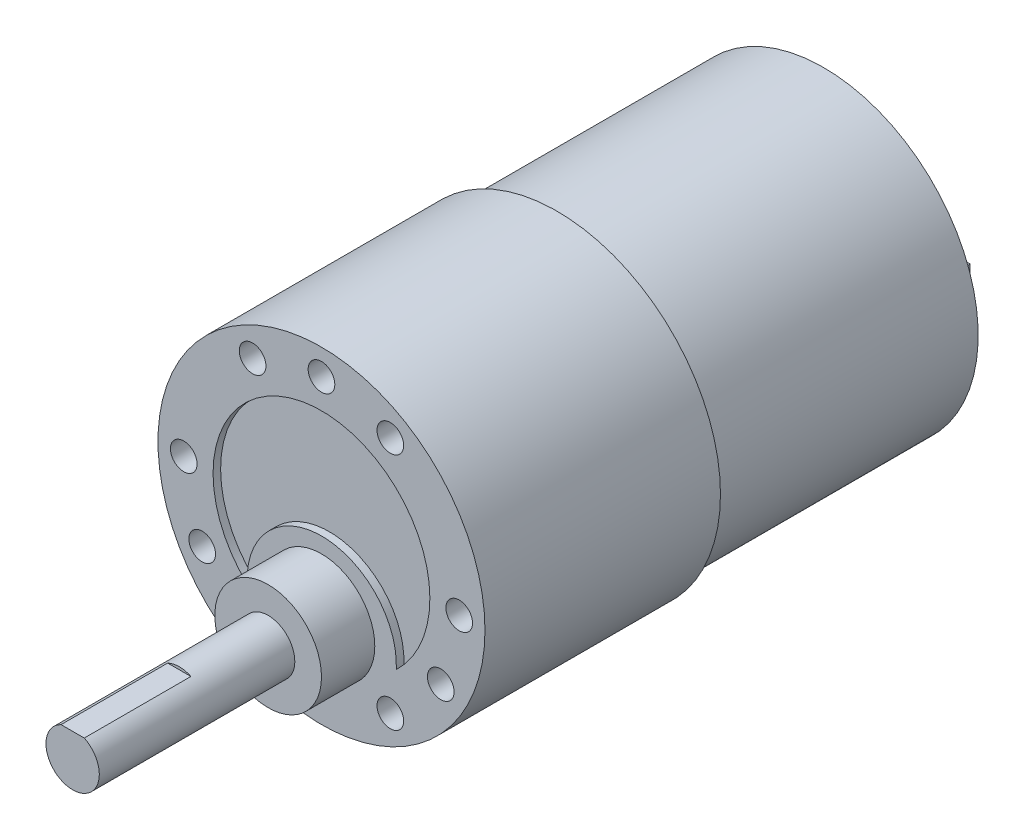
ISO-10303-21;
HEADER;
FILE_DESCRIPTION(('STEP AP214'),'2;1');
FILE_NAME('part.step','',(''),(''),'','','');
FILE_SCHEMA(('AUTOMOTIVE_DESIGN { 1 0 10303 214 1 1 1 1 }'));
ENDSEC;
DATA;
#1=APPLICATION_CONTEXT('core data for automotive mechanical design processes');
#2=APPLICATION_PROTOCOL_DEFINITION('international standard','automotive_design',2000,#1);
#3=PRODUCT_CONTEXT('',#1,'mechanical');
#4=PRODUCT('Part','Part','',(#3));
#5=PRODUCT_RELATED_PRODUCT_CATEGORY('part','',(#4));
#6=PRODUCT_DEFINITION_FORMATION('','',#4);
#7=PRODUCT_DEFINITION_CONTEXT('part definition',#1,'design');
#8=PRODUCT_DEFINITION('design','',#6,#7);
#9=PRODUCT_DEFINITION_SHAPE('','',#8);
#10=(LENGTH_UNIT() NAMED_UNIT(*) SI_UNIT(.MILLI.,.METRE.));
#11=(NAMED_UNIT(*) PLANE_ANGLE_UNIT() SI_UNIT($,.RADIAN.));
#12=(NAMED_UNIT(*) SI_UNIT($,.STERADIAN.) SOLID_ANGLE_UNIT());
#13=UNCERTAINTY_MEASURE_WITH_UNIT(LENGTH_MEASURE(1.E-05),#10,'distance_accuracy_value','');
#14=(GEOMETRIC_REPRESENTATION_CONTEXT(3) GLOBAL_UNCERTAINTY_ASSIGNED_CONTEXT((#13)) GLOBAL_UNIT_ASSIGNED_CONTEXT((#10,
#11,#12)) REPRESENTATION_CONTEXT('',''));
#15=CARTESIAN_POINT('',(0.,0.,0.));
#16=DIRECTION('',(0.,0.,1.));
#17=DIRECTION('',(1.,0.,0.));
#18=AXIS2_PLACEMENT_3D('',#15,#16,#17);
#19=CARTESIAN_POINT('',(0.,0.,-30.));
#20=DIRECTION('',(0.,0.,-1.));
#21=DIRECTION('',(-1.,0.,0.));
#22=AXIS2_PLACEMENT_3D('',#19,#20,#21);
#23=PLANE('',#22);
#24=CARTESIAN_POINT('',(11.25,0.,-30.));
#25=DIRECTION('',(0.,0.,-1.));
#26=DIRECTION('',(-1.,0.,0.));
#27=AXIS2_PLACEMENT_3D('',#24,#25,#26);
#28=CIRCLE('',#27,2.25);
#29=CARTESIAN_POINT('',(9.,0.,-30.));
#30=VERTEX_POINT('',#29);
#31=EDGE_CURVE('E217',#30,#30,#28,.T.);
#32=ORIENTED_EDGE('',*,*,#31,.F.);
#33=EDGE_LOOP('',(#32));
#34=FACE_BOUND('',#33,.T.);
#35=CARTESIAN_POINT('',(0.,0.,-30.));
#36=DIRECTION('',(0.,0.,-1.));
#37=DIRECTION('',(-1.,0.,0.));
#38=AXIS2_PLACEMENT_3D('',#35,#36,#37);
#39=CIRCLE('',#38,3.9);
#40=CARTESIAN_POINT('',(-3.9,0.,-30.));
#41=VERTEX_POINT('',#40);
#42=EDGE_CURVE('E12',#41,#41,#39,.T.);
#43=ORIENTED_EDGE('',*,*,#42,.F.);
#44=EDGE_LOOP('',(#43));
#45=FACE_BOUND('',#44,.T.);
#46=CARTESIAN_POINT('',(0.,0.,-30.));
#47=DIRECTION('',(0.,0.,-1.));
#48=DIRECTION('',(-1.,0.,0.));
#49=AXIS2_PLACEMENT_3D('',#46,#47,#48);
#50=CIRCLE('',#49,17.4);
#51=CARTESIAN_POINT('',(-17.4,0.,-30.));
#52=VERTEX_POINT('',#51);
#53=EDGE_CURVE('E225',#52,#52,#50,.T.);
#54=ORIENTED_EDGE('',*,*,#53,.T.);
#55=EDGE_LOOP('',(#54));
#56=FACE_BOUND('',#55,.T.);
#57=CARTESIAN_POINT('',(-11.25,0.,-30.));
#58=DIRECTION('',(0.,0.,-1.));
#59=DIRECTION('',(1.,0.,0.));
#60=AXIS2_PLACEMENT_3D('',#57,#58,#59);
#61=CIRCLE('',#60,2.25);
#62=CARTESIAN_POINT('',(-9.,0.,-30.));
#63=VERTEX_POINT('',#62);
#64=EDGE_CURVE('E199',#63,#63,#61,.T.);
#65=ORIENTED_EDGE('',*,*,#64,.F.);
#66=EDGE_LOOP('',(#65));
#67=FACE_BOUND('',#66,.T.);
#68=ADVANCED_FACE('F48',(#34,#45,#56,#67),#23,.T.);
#69=CARTESIAN_POINT('',(0.,0.,26.5));
#70=DIRECTION('',(0.,0.,-1.));
#71=DIRECTION('',(-1.,0.,0.));
#72=AXIS2_PLACEMENT_3D('',#69,#70,#71);
#73=CYLINDRICAL_SURFACE('',#72,18.4);
#74=CARTESIAN_POINT('',(0.,0.,26.5));
#75=DIRECTION('',(0.,0.,1.));
#76=DIRECTION('',(1.,0.,0.));
#77=AXIS2_PLACEMENT_3D('',#74,#75,#76);
#78=CIRCLE('',#77,18.4);
#79=CARTESIAN_POINT('',(18.4,0.,26.5));
#80=VERTEX_POINT('',#79);
#81=EDGE_CURVE('E249',#80,#80,#78,.T.);
#82=ORIENTED_EDGE('',*,*,#81,.F.);
#83=EDGE_LOOP('',(#82));
#84=FACE_BOUND('',#83,.T.);
#85=CARTESIAN_POINT('',(0.,0.,0.));
#86=DIRECTION('',(0.,0.,1.));
#87=DIRECTION('',(1.,0.,0.));
#88=AXIS2_PLACEMENT_3D('',#85,#86,#87);
#89=CIRCLE('',#88,18.4);
#90=CARTESIAN_POINT('',(18.4,0.,0.));
#91=VERTEX_POINT('',#90);
#92=EDGE_CURVE('E52',#91,#91,#89,.T.);
#93=ORIENTED_EDGE('',*,*,#92,.T.);
#94=EDGE_LOOP('',(#93));
#95=FACE_BOUND('',#94,.T.);
#96=ADVANCED_FACE('F50',(#84,#95),#73,.T.);
#97=CARTESIAN_POINT('',(0.,0.,26.5));
#98=DIRECTION('',(0.,0.,1.));
#99=DIRECTION('',(1.,0.,0.));
#100=AXIS2_PLACEMENT_3D('',#97,#98,#99);
#101=PLANE('',#100);
#102=CARTESIAN_POINT('',(-1.78589781851884E-12,-7.75000000000207,26.5));
#103=DIRECTION('',(0.,0.,1.));
#104=DIRECTION('',(1.,0.,0.));
#105=AXIS2_PLACEMENT_3D('',#102,#103,#104);
#106=CIRCLE('',#105,6.);
#107=CARTESIAN_POINT('',(5.99999999999821,-7.75000000000207,26.5));
#108=VERTEX_POINT('',#107);
#109=EDGE_CURVE('E246',#108,#108,#106,.T.);
#110=ORIENTED_EDGE('',*,*,#109,.F.);
#111=EDGE_LOOP('',(#110));
#112=FACE_BOUND('',#111,.T.);
#113=CARTESIAN_POINT('',(-15.5,0.,26.5));
#114=DIRECTION('',(0.,0.,1.));
#115=DIRECTION('',(1.,0.,0.));
#116=AXIS2_PLACEMENT_3D('',#113,#114,#115);
#117=CIRCLE('',#116,1.5);
#118=CARTESIAN_POINT('',(-14.,0.,26.5));
#119=VERTEX_POINT('',#118);
#120=EDGE_CURVE('E260',#119,#119,#117,.T.);
#121=ORIENTED_EDGE('',*,*,#120,.F.);
#122=EDGE_LOOP('',(#121));
#123=FACE_BOUND('',#122,.T.);
#124=CARTESIAN_POINT('',(-7.75000000000016,-13.4233937586587,26.5));
#125=DIRECTION('',(0.,0.,1.));
#126=DIRECTION('',(1.,0.,0.));
#127=AXIS2_PLACEMENT_3D('',#124,#125,#126);
#128=CIRCLE('',#127,1.5);
#129=CARTESIAN_POINT('',(-6.25000000000015,-13.4233937586587,26.5));
#130=VERTEX_POINT('',#129);
#131=EDGE_CURVE('E253',#130,#130,#128,.T.);
#132=ORIENTED_EDGE('',*,*,#131,.F.);
#133=EDGE_LOOP('',(#132));
#134=FACE_BOUND('',#133,.T.);
#135=CARTESIAN_POINT('',(7.74999999999987,-13.4233937586589,26.5));
#136=DIRECTION('',(0.,0.,1.));
#137=DIRECTION('',(1.,0.,0.));
#138=AXIS2_PLACEMENT_3D('',#135,#136,#137);
#139=CIRCLE('',#138,1.5);
#140=CARTESIAN_POINT('',(9.24999999999988,-13.4233937586589,26.5));
#141=VERTEX_POINT('',#140);
#142=EDGE_CURVE('E267',#141,#141,#139,.T.);
#143=ORIENTED_EDGE('',*,*,#142,.F.);
#144=EDGE_LOOP('',(#143));
#145=FACE_BOUND('',#144,.T.);
#146=CARTESIAN_POINT('',(15.5,-1.08235921504137E-13,26.5));
#147=DIRECTION('',(0.,0.,1.));
#148=DIRECTION('',(1.,0.,0.));
#149=AXIS2_PLACEMENT_3D('',#146,#147,#148);
#150=CIRCLE('',#149,1.5);
#151=CARTESIAN_POINT('',(17.,-1.08235921504137E-13,26.5));
#152=VERTEX_POINT('',#151);
#153=EDGE_CURVE('E284',#152,#152,#150,.T.);
#154=ORIENTED_EDGE('',*,*,#153,.F.);
#155=EDGE_LOOP('',(#154));
#156=FACE_BOUND('',#155,.T.);
#157=CARTESIAN_POINT('',(7.75000000000006,13.4233937586588,26.5));
#158=DIRECTION('',(0.,0.,1.));
#159=DIRECTION('',(1.,0.,0.));
#160=AXIS2_PLACEMENT_3D('',#157,#158,#159);
#161=CIRCLE('',#160,1.5);
#162=CARTESIAN_POINT('',(9.25000000000006,13.4233937586588,26.5));
#163=VERTEX_POINT('',#162);
#164=EDGE_CURVE('E278',#163,#163,#161,.T.);
#165=ORIENTED_EDGE('',*,*,#164,.F.);
#166=EDGE_LOOP('',(#165));
#167=FACE_BOUND('',#166,.T.);
#168=CARTESIAN_POINT('',(-7.74999999999997,13.4233937586588,26.5));
#169=DIRECTION('',(0.,0.,1.));
#170=DIRECTION('',(1.,0.,0.));
#171=AXIS2_PLACEMENT_3D('',#168,#169,#170);
#172=CIRCLE('',#171,1.5);
#173=CARTESIAN_POINT('',(-6.24999999999997,13.4233937586588,26.5));
#174=VERTEX_POINT('',#173);
#175=EDGE_CURVE('E272',#174,#174,#172,.T.);
#176=ORIENTED_EDGE('',*,*,#175,.F.);
#177=EDGE_LOOP('',(#176));
#178=FACE_BOUND('',#177,.T.);
#179=CARTESIAN_POINT('',(0.,15.5,26.5));
#180=DIRECTION('',(0.,0.,1.));
#181=DIRECTION('',(1.,0.,0.));
#182=AXIS2_PLACEMENT_3D('',#179,#180,#181);
#183=CIRCLE('',#182,1.5);
#184=CARTESIAN_POINT('',(1.5,15.5,26.5));
#185=VERTEX_POINT('',#184);
#186=EDGE_CURVE('E296',#185,#185,#183,.T.);
#187=ORIENTED_EDGE('',*,*,#186,.F.);
#188=EDGE_LOOP('',(#187));
#189=FACE_BOUND('',#188,.T.);
#190=CARTESIAN_POINT('',(13.4233937586576,-7.75000000000207,26.5));
#191=DIRECTION('',(0.,0.,1.));
#192=DIRECTION('',(1.,0.,0.));
#193=AXIS2_PLACEMENT_3D('',#190,#191,#192);
#194=CIRCLE('',#193,1.49999999999779);
#195=CARTESIAN_POINT('',(14.9233937586554,-7.75000000000207,26.5));
#196=VERTEX_POINT('',#195);
#197=EDGE_CURVE('E302',#196,#196,#194,.T.);
#198=ORIENTED_EDGE('',*,*,#197,.F.);
#199=EDGE_LOOP('',(#198));
#200=FACE_BOUND('',#199,.T.);
#201=CARTESIAN_POINT('',(-13.4233937586612,-7.74999999999587,26.5));
#202=DIRECTION('',(0.,0.,1.));
#203=DIRECTION('',(1.,0.,0.));
#204=AXIS2_PLACEMENT_3D('',#201,#202,#203);
#205=CIRCLE('',#204,1.49999999999558);
#206=CARTESIAN_POINT('',(-11.9233937586656,-7.74999999999587,26.5));
#207=VERTEX_POINT('',#206);
#208=EDGE_CURVE('E259',#207,#207,#205,.T.);
#209=ORIENTED_EDGE('',*,*,#208,.F.);
#210=EDGE_LOOP('',(#209));
#211=FACE_BOUND('',#210,.T.);
#212=CARTESIAN_POINT('',(0.0300122031200254,-8.39994638480889,26.5));
#213=DIRECTION('',(0.,0.,1.));
#214=DIRECTION('',(1.,0.,0.));
#215=AXIS2_PLACEMENT_3D('',#212,#213,#214);
#216=CIRCLE('',#215,8.4);
#217=CARTESIAN_POINT('',(-8.35571384552702,-8.88943452260424,26.5));
#218=VERTEX_POINT('',#217);
#219=CARTESIAN_POINT('',(8.41902189984086,-8.8295,26.5));
#220=VERTEX_POINT('',#219);
#221=EDGE_CURVE('E73',#218,#220,#216,.F.);
#222=ORIENTED_EDGE('',*,*,#221,.F.);
#223=CARTESIAN_POINT('',(0.,0.,26.5));
#224=DIRECTION('',(0.,0.,1.));
#225=DIRECTION('',(1.,0.,0.));
#226=AXIS2_PLACEMENT_3D('',#223,#224,#225);
#227=CIRCLE('',#226,12.2);
#228=EDGE_CURVE('E295',#220,#218,#227,.T.);
#229=ORIENTED_EDGE('',*,*,#228,.F.);
#230=EDGE_LOOP('',(#222,#229));
#231=FACE_BOUND('',#230,.T.);
#232=ORIENTED_EDGE('',*,*,#81,.T.);
#233=EDGE_LOOP('',(#232));
#234=FACE_BOUND('',#233,.T.);
#235=ADVANCED_FACE('F332',(#112,#123,#134,#145,#156,#167,#178,#189,#200,#211,#231,#234),#101,.T.);
#236=CARTESIAN_POINT('',(0.,0.,0.));
#237=DIRECTION('',(0.,0.,1.));
#238=DIRECTION('',(1.,0.,0.));
#239=AXIS2_PLACEMENT_3D('',#236,#237,#238);
#240=PLANE('',#239);
#241=CARTESIAN_POINT('',(0.,0.,0.));
#242=DIRECTION('',(0.,0.,-1.));
#243=DIRECTION('',(-1.,0.,0.));
#244=AXIS2_PLACEMENT_3D('',#241,#242,#243);
#245=CIRCLE('',#244,17.4);
#246=CARTESIAN_POINT('',(-17.4,0.,0.));
#247=VERTEX_POINT('',#246);
#248=EDGE_CURVE('E57',#247,#247,#245,.T.);
#249=ORIENTED_EDGE('',*,*,#248,.F.);
#250=EDGE_LOOP('',(#249));
#251=FACE_BOUND('',#250,.T.);
#252=ORIENTED_EDGE('',*,*,#92,.F.);
#253=EDGE_LOOP('',(#252));
#254=FACE_BOUND('',#253,.T.);
#255=ADVANCED_FACE('F329',(#251,#254),#240,.F.);
#256=CARTESIAN_POINT('',(0.0300122031200254,-8.39994638480889,25.65));
#257=DIRECTION('',(0.,0.,1.));
#258=DIRECTION('',(1.,0.,0.));
#259=AXIS2_PLACEMENT_3D('',#256,#257,#258);
#260=CYLINDRICAL_SURFACE('',#259,8.4);
#261=ORIENTED_EDGE('',*,*,#221,.T.);
#262=DIRECTION('',(0.,0.,1.));
#263=VECTOR('',#262,1.);
#264=CARTESIAN_POINT('',(8.41902189984086,-8.8295,25.65));
#265=LINE('',#264,#263);
#266=CARTESIAN_POINT('',(8.41902189984086,-8.8295,25.65));
#267=VERTEX_POINT('',#266);
#268=EDGE_CURVE('E320',#267,#220,#265,.T.);
#269=ORIENTED_EDGE('',*,*,#268,.F.);
#270=CARTESIAN_POINT('',(0.0300122031200254,-8.39994638480889,25.65));
#271=DIRECTION('',(0.,0.,1.));
#272=DIRECTION('',(1.,0.,0.));
#273=AXIS2_PLACEMENT_3D('',#270,#271,#272);
#274=CIRCLE('',#273,8.4);
#275=CARTESIAN_POINT('',(-8.35571384552702,-8.88943452260424,25.65));
#276=VERTEX_POINT('',#275);
#277=EDGE_CURVE('E313',#276,#267,#274,.F.);
#278=ORIENTED_EDGE('',*,*,#277,.F.);
#279=DIRECTION('',(0.,0.,1.));
#280=VECTOR('',#279,1.);
#281=CARTESIAN_POINT('',(-8.35571384552702,-8.88943452260424,25.65));
#282=LINE('',#281,#280);
#283=EDGE_CURVE('E316',#276,#218,#282,.T.);
#284=ORIENTED_EDGE('',*,*,#283,.T.);
#285=EDGE_LOOP('',(#261,#269,#278,#284));
#286=FACE_BOUND('',#285,.T.);
#287=ADVANCED_FACE('F331',(#286),#260,.T.);
#288=CARTESIAN_POINT('',(0.,0.,25.65));
#289=DIRECTION('',(0.,0.,1.));
#290=DIRECTION('',(1.,0.,0.));
#291=AXIS2_PLACEMENT_3D('',#288,#289,#290);
#292=CYLINDRICAL_SURFACE('',#291,12.2);
#293=ORIENTED_EDGE('',*,*,#228,.T.);
#294=ORIENTED_EDGE('',*,*,#283,.F.);
#295=CARTESIAN_POINT('',(0.,0.,25.65));
#296=DIRECTION('',(0.,0.,1.));
#297=DIRECTION('',(1.,0.,0.));
#298=AXIS2_PLACEMENT_3D('',#295,#296,#297);
#299=CIRCLE('',#298,12.2);
#300=EDGE_CURVE('E310',#267,#276,#299,.T.);
#301=ORIENTED_EDGE('',*,*,#300,.F.);
#302=ORIENTED_EDGE('',*,*,#268,.T.);
#303=EDGE_LOOP('',(#293,#294,#301,#302));
#304=FACE_BOUND('',#303,.T.);
#305=ADVANCED_FACE('F338',(#304),#292,.F.);
#306=CARTESIAN_POINT('',(0.,0.,25.65));
#307=DIRECTION('',(0.,0.,1.));
#308=DIRECTION('',(1.,0.,0.));
#309=AXIS2_PLACEMENT_3D('',#306,#307,#308);
#310=PLANE('',#309);
#311=ORIENTED_EDGE('',*,*,#300,.T.);
#312=ORIENTED_EDGE('',*,*,#277,.T.);
#313=EDGE_LOOP('',(#311,#312));
#314=FACE_BOUND('',#313,.T.);
#315=ADVANCED_FACE('F454',(#314),#310,.T.);
#316=CARTESIAN_POINT('',(-13.4233937586612,-7.74999999999587,1.5));
#317=DIRECTION('',(0.,0.,1.));
#318=DIRECTION('',(1.,0.,0.));
#319=AXIS2_PLACEMENT_3D('',#316,#317,#318);
#320=CYLINDRICAL_SURFACE('',#319,1.49999999999558);
#321=CARTESIAN_POINT('',(-13.4233937586612,-7.74999999999587,1.5));
#322=DIRECTION('',(0.,0.,1.));
#323=DIRECTION('',(1.,0.,0.));
#324=AXIS2_PLACEMENT_3D('',#321,#322,#323);
#325=CIRCLE('',#324,1.49999999999558);
#326=CARTESIAN_POINT('',(-11.9233937586656,-7.74999999999587,1.5));
#327=VERTEX_POINT('',#326);
#328=EDGE_CURVE('E305',#327,#327,#325,.T.);
#329=ORIENTED_EDGE('',*,*,#328,.F.);
#330=EDGE_LOOP('',(#329));
#331=FACE_BOUND('',#330,.T.);
#332=ORIENTED_EDGE('',*,*,#208,.T.);
#333=EDGE_LOOP('',(#332));
#334=FACE_BOUND('',#333,.T.);
#335=ADVANCED_FACE('F450',(#331,#334),#320,.F.);
#336=CARTESIAN_POINT('',(-13.4233937586612,-7.74999999999587,1.5));
#337=DIRECTION('',(0.,0.,1.));
#338=DIRECTION('',(1.,0.,0.));
#339=AXIS2_PLACEMENT_3D('',#336,#337,#338);
#340=PLANE('',#339);
#341=ORIENTED_EDGE('',*,*,#328,.T.);
#342=EDGE_LOOP('',(#341));
#343=FACE_BOUND('',#342,.T.);
#344=ADVANCED_FACE('F446',(#343),#340,.T.);
#345=CARTESIAN_POINT('',(13.4233937586576,-7.75000000000207,1.5));
#346=DIRECTION('',(0.,0.,1.));
#347=DIRECTION('',(1.,0.,0.));
#348=AXIS2_PLACEMENT_3D('',#345,#346,#347);
#349=CYLINDRICAL_SURFACE('',#348,1.49999999999779);
#350=CARTESIAN_POINT('',(13.4233937586576,-7.75000000000207,1.5));
#351=DIRECTION('',(0.,0.,1.));
#352=DIRECTION('',(1.,0.,0.));
#353=AXIS2_PLACEMENT_3D('',#350,#351,#352);
#354=CIRCLE('',#353,1.49999999999779);
#355=CARTESIAN_POINT('',(14.9233937586554,-7.75000000000207,1.5));
#356=VERTEX_POINT('',#355);
#357=EDGE_CURVE('E299',#356,#356,#354,.T.);
#358=ORIENTED_EDGE('',*,*,#357,.F.);
#359=EDGE_LOOP('',(#358));
#360=FACE_BOUND('',#359,.T.);
#361=ORIENTED_EDGE('',*,*,#197,.T.);
#362=EDGE_LOOP('',(#361));
#363=FACE_BOUND('',#362,.T.);
#364=ADVANCED_FACE('F442',(#360,#363),#349,.F.);
#365=CARTESIAN_POINT('',(13.4233937586576,-7.75000000000207,1.5));
#366=DIRECTION('',(0.,0.,1.));
#367=DIRECTION('',(1.,0.,0.));
#368=AXIS2_PLACEMENT_3D('',#365,#366,#367);
#369=PLANE('',#368);
#370=ORIENTED_EDGE('',*,*,#357,.T.);
#371=EDGE_LOOP('',(#370));
#372=FACE_BOUND('',#371,.T.);
#373=ADVANCED_FACE('F438',(#372),#369,.T.);
#374=CARTESIAN_POINT('',(0.,15.5,1.5));
#375=DIRECTION('',(0.,0.,1.));
#376=DIRECTION('',(1.,0.,0.));
#377=AXIS2_PLACEMENT_3D('',#374,#375,#376);
#378=CYLINDRICAL_SURFACE('',#377,1.5);
#379=CARTESIAN_POINT('',(0.,15.5,1.5));
#380=DIRECTION('',(0.,0.,1.));
#381=DIRECTION('',(1.,0.,0.));
#382=AXIS2_PLACEMENT_3D('',#379,#380,#381);
#383=CIRCLE('',#382,1.5);
#384=CARTESIAN_POINT('',(1.5,15.5,1.5));
#385=VERTEX_POINT('',#384);
#386=EDGE_CURVE('E292',#385,#385,#383,.T.);
#387=ORIENTED_EDGE('',*,*,#386,.F.);
#388=EDGE_LOOP('',(#387));
#389=FACE_BOUND('',#388,.T.);
#390=ORIENTED_EDGE('',*,*,#186,.T.);
#391=EDGE_LOOP('',(#390));
#392=FACE_BOUND('',#391,.T.);
#393=ADVANCED_FACE('F434',(#389,#392),#378,.F.);
#394=CARTESIAN_POINT('',(0.,15.5,1.5));
#395=DIRECTION('',(0.,0.,1.));
#396=DIRECTION('',(1.,0.,0.));
#397=AXIS2_PLACEMENT_3D('',#394,#395,#396);
#398=PLANE('',#397);
#399=ORIENTED_EDGE('',*,*,#386,.T.);
#400=EDGE_LOOP('',(#399));
#401=FACE_BOUND('',#400,.T.);
#402=ADVANCED_FACE('F408',(#401),#398,.T.);
#403=CARTESIAN_POINT('',(-7.74999999999997,13.4233937586588,21.5));
#404=DIRECTION('',(0.,0.,1.));
#405=DIRECTION('',(1.,0.,0.));
#406=AXIS2_PLACEMENT_3D('',#403,#404,#405);
#407=CYLINDRICAL_SURFACE('',#406,1.5);
#408=CARTESIAN_POINT('',(-7.74999999999997,13.4233937586588,21.5));
#409=DIRECTION('',(0.,0.,1.));
#410=DIRECTION('',(1.,0.,0.));
#411=AXIS2_PLACEMENT_3D('',#408,#409,#410);
#412=CIRCLE('',#411,1.5);
#413=CARTESIAN_POINT('',(-6.24999999999997,13.4233937586588,21.5));
#414=VERTEX_POINT('',#413);
#415=EDGE_CURVE('E263',#414,#414,#412,.T.);
#416=ORIENTED_EDGE('',*,*,#415,.F.);
#417=EDGE_LOOP('',(#416));
#418=FACE_BOUND('',#417,.T.);
#419=ORIENTED_EDGE('',*,*,#175,.T.);
#420=EDGE_LOOP('',(#419));
#421=FACE_BOUND('',#420,.T.);
#422=ADVANCED_FACE('F404',(#418,#421),#407,.F.);
#423=CARTESIAN_POINT('',(-7.74999999999997,13.4233937586588,21.5));
#424=DIRECTION('',(0.,0.,1.));
#425=DIRECTION('',(1.,0.,0.));
#426=AXIS2_PLACEMENT_3D('',#423,#424,#425);
#427=PLANE('',#426);
#428=ORIENTED_EDGE('',*,*,#415,.T.);
#429=EDGE_LOOP('',(#428));
#430=FACE_BOUND('',#429,.T.);
#431=ADVANCED_FACE('F400',(#430),#427,.T.);
#432=CARTESIAN_POINT('',(7.75000000000006,13.4233937586588,21.5));
#433=DIRECTION('',(0.,0.,1.));
#434=DIRECTION('',(1.,0.,0.));
#435=AXIS2_PLACEMENT_3D('',#432,#433,#434);
#436=CYLINDRICAL_SURFACE('',#435,1.5);
#437=CARTESIAN_POINT('',(7.75000000000006,13.4233937586588,21.5));
#438=DIRECTION('',(0.,0.,1.));
#439=DIRECTION('',(1.,0.,0.));
#440=AXIS2_PLACEMENT_3D('',#437,#438,#439);
#441=CIRCLE('',#440,1.5);
#442=CARTESIAN_POINT('',(9.25000000000006,13.4233937586588,21.5));
#443=VERTEX_POINT('',#442);
#444=EDGE_CURVE('E275',#443,#443,#441,.T.);
#445=ORIENTED_EDGE('',*,*,#444,.F.);
#446=EDGE_LOOP('',(#445));
#447=FACE_BOUND('',#446,.T.);
#448=ORIENTED_EDGE('',*,*,#164,.T.);
#449=EDGE_LOOP('',(#448));
#450=FACE_BOUND('',#449,.T.);
#451=ADVANCED_FACE('F403',(#447,#450),#436,.F.);
#452=CARTESIAN_POINT('',(7.75000000000006,13.4233937586588,21.5));
#453=DIRECTION('',(0.,0.,1.));
#454=DIRECTION('',(1.,0.,0.));
#455=AXIS2_PLACEMENT_3D('',#452,#453,#454);
#456=PLANE('',#455);
#457=ORIENTED_EDGE('',*,*,#444,.T.);
#458=EDGE_LOOP('',(#457));
#459=FACE_BOUND('',#458,.T.);
#460=ADVANCED_FACE('F410',(#459),#456,.T.);
#461=CARTESIAN_POINT('',(15.5,-1.08235921504137E-13,21.5));
#462=DIRECTION('',(0.,0.,1.));
#463=DIRECTION('',(1.,0.,0.));
#464=AXIS2_PLACEMENT_3D('',#461,#462,#463);
#465=CYLINDRICAL_SURFACE('',#464,1.5);
#466=CARTESIAN_POINT('',(15.5,-1.08235921504137E-13,21.5));
#467=DIRECTION('',(0.,0.,1.));
#468=DIRECTION('',(1.,0.,0.));
#469=AXIS2_PLACEMENT_3D('',#466,#467,#468);
#470=CIRCLE('',#469,1.5);
#471=CARTESIAN_POINT('',(17.,-1.08235921504137E-13,21.5));
#472=VERTEX_POINT('',#471);
#473=EDGE_CURVE('E281',#472,#472,#470,.T.);
#474=ORIENTED_EDGE('',*,*,#473,.F.);
#475=EDGE_LOOP('',(#474));
#476=FACE_BOUND('',#475,.T.);
#477=ORIENTED_EDGE('',*,*,#153,.T.);
#478=EDGE_LOOP('',(#477));
#479=FACE_BOUND('',#478,.T.);
#480=ADVANCED_FACE('F413',(#476,#479),#465,.F.);
#481=CARTESIAN_POINT('',(15.5,-1.08235921504137E-13,21.5));
#482=DIRECTION('',(0.,0.,1.));
#483=DIRECTION('',(1.,0.,0.));
#484=AXIS2_PLACEMENT_3D('',#481,#482,#483);
#485=PLANE('',#484);
#486=ORIENTED_EDGE('',*,*,#473,.T.);
#487=EDGE_LOOP('',(#486));
#488=FACE_BOUND('',#487,.T.);
#489=ADVANCED_FACE('F418',(#488),#485,.T.);
#490=CARTESIAN_POINT('',(7.74999999999987,-13.4233937586589,21.5));
#491=DIRECTION('',(0.,0.,1.));
#492=DIRECTION('',(1.,0.,0.));
#493=AXIS2_PLACEMENT_3D('',#490,#491,#492);
#494=CYLINDRICAL_SURFACE('',#493,1.5);
#495=CARTESIAN_POINT('',(7.74999999999987,-13.4233937586589,21.5));
#496=DIRECTION('',(0.,0.,1.));
#497=DIRECTION('',(1.,0.,0.));
#498=AXIS2_PLACEMENT_3D('',#495,#496,#497);
#499=CIRCLE('',#498,1.5);
#500=CARTESIAN_POINT('',(9.24999999999988,-13.4233937586589,21.5));
#501=VERTEX_POINT('',#500);
#502=EDGE_CURVE('E287',#501,#501,#499,.T.);
#503=ORIENTED_EDGE('',*,*,#502,.F.);
#504=EDGE_LOOP('',(#503));
#505=FACE_BOUND('',#504,.T.);
#506=ORIENTED_EDGE('',*,*,#142,.T.);
#507=EDGE_LOOP('',(#506));
#508=FACE_BOUND('',#507,.T.);
#509=ADVANCED_FACE('F421',(#505,#508),#494,.F.);
#510=CARTESIAN_POINT('',(7.74999999999987,-13.4233937586589,21.5));
#511=DIRECTION('',(0.,0.,1.));
#512=DIRECTION('',(1.,0.,0.));
#513=AXIS2_PLACEMENT_3D('',#510,#511,#512);
#514=PLANE('',#513);
#515=ORIENTED_EDGE('',*,*,#502,.T.);
#516=EDGE_LOOP('',(#515));
#517=FACE_BOUND('',#516,.T.);
#518=ADVANCED_FACE('F398',(#517),#514,.T.);
#519=CARTESIAN_POINT('',(-7.75000000000016,-13.4233937586587,21.5));
#520=DIRECTION('',(0.,0.,1.));
#521=DIRECTION('',(1.,0.,0.));
#522=AXIS2_PLACEMENT_3D('',#519,#520,#521);
#523=CYLINDRICAL_SURFACE('',#522,1.5);
#524=CARTESIAN_POINT('',(-7.75000000000016,-13.4233937586587,21.5));
#525=DIRECTION('',(0.,0.,1.));
#526=DIRECTION('',(1.,0.,0.));
#527=AXIS2_PLACEMENT_3D('',#524,#525,#526);
#528=CIRCLE('',#527,1.5);
#529=CARTESIAN_POINT('',(-6.25000000000015,-13.4233937586587,21.5));
#530=VERTEX_POINT('',#529);
#531=EDGE_CURVE('E264',#530,#530,#528,.T.);
#532=ORIENTED_EDGE('',*,*,#531,.F.);
#533=EDGE_LOOP('',(#532));
#534=FACE_BOUND('',#533,.T.);
#535=ORIENTED_EDGE('',*,*,#131,.T.);
#536=EDGE_LOOP('',(#535));
#537=FACE_BOUND('',#536,.T.);
#538=ADVANCED_FACE('F394',(#534,#537),#523,.F.);
#539=CARTESIAN_POINT('',(-7.75000000000016,-13.4233937586587,21.5));
#540=DIRECTION('',(0.,0.,1.));
#541=DIRECTION('',(1.,0.,0.));
#542=AXIS2_PLACEMENT_3D('',#539,#540,#541);
#543=PLANE('',#542);
#544=ORIENTED_EDGE('',*,*,#531,.T.);
#545=EDGE_LOOP('',(#544));
#546=FACE_BOUND('',#545,.T.);
#547=ADVANCED_FACE('F390',(#546),#543,.T.);
#548=CARTESIAN_POINT('',(-15.5,0.,21.5));
#549=DIRECTION('',(0.,0.,1.));
#550=DIRECTION('',(1.,0.,0.));
#551=AXIS2_PLACEMENT_3D('',#548,#549,#550);
#552=CYLINDRICAL_SURFACE('',#551,1.5);
#553=CARTESIAN_POINT('',(-15.5,0.,21.5));
#554=DIRECTION('',(0.,0.,1.));
#555=DIRECTION('',(1.,0.,0.));
#556=AXIS2_PLACEMENT_3D('',#553,#554,#555);
#557=CIRCLE('',#556,1.5);
#558=CARTESIAN_POINT('',(-14.,0.,21.5));
#559=VERTEX_POINT('',#558);
#560=EDGE_CURVE('E256',#559,#559,#557,.T.);
#561=ORIENTED_EDGE('',*,*,#560,.F.);
#562=EDGE_LOOP('',(#561));
#563=FACE_BOUND('',#562,.T.);
#564=ORIENTED_EDGE('',*,*,#120,.T.);
#565=EDGE_LOOP('',(#564));
#566=FACE_BOUND('',#565,.T.);
#567=ADVANCED_FACE('F386',(#563,#566),#552,.F.);
#568=CARTESIAN_POINT('',(-15.5,0.,21.5));
#569=DIRECTION('',(0.,0.,1.));
#570=DIRECTION('',(1.,0.,0.));
#571=AXIS2_PLACEMENT_3D('',#568,#569,#570);
#572=PLANE('',#571);
#573=ORIENTED_EDGE('',*,*,#560,.T.);
#574=EDGE_LOOP('',(#573));
#575=FACE_BOUND('',#574,.T.);
#576=ADVANCED_FACE('F382',(#575),#572,.T.);
#577=CARTESIAN_POINT('',(-1.78589781851884E-12,-7.75000000000207,32.5));
#578=DIRECTION('',(0.,0.,-1.));
#579=DIRECTION('',(-1.,0.,0.));
#580=AXIS2_PLACEMENT_3D('',#577,#578,#579);
#581=CYLINDRICAL_SURFACE('',#580,6.);
#582=CARTESIAN_POINT('',(-1.78589781851884E-12,-7.75000000000207,32.5));
#583=DIRECTION('',(0.,0.,1.));
#584=DIRECTION('',(1.,0.,0.));
#585=AXIS2_PLACEMENT_3D('',#582,#583,#584);
#586=CIRCLE('',#585,6.);
#587=CARTESIAN_POINT('',(5.99999999999821,-7.75000000000207,32.5));
#588=VERTEX_POINT('',#587);
#589=EDGE_CURVE('E250',#588,#588,#586,.T.);
#590=ORIENTED_EDGE('',*,*,#589,.F.);
#591=EDGE_LOOP('',(#590));
#592=FACE_BOUND('',#591,.T.);
#593=ORIENTED_EDGE('',*,*,#109,.T.);
#594=EDGE_LOOP('',(#593));
#595=FACE_BOUND('',#594,.T.);
#596=ADVANCED_FACE('F378',(#592,#595),#581,.T.);
#597=CARTESIAN_POINT('',(-1.78589781851884E-12,-7.75000000000207,32.5));
#598=DIRECTION('',(0.,0.,1.));
#599=DIRECTION('',(1.,0.,0.));
#600=AXIS2_PLACEMENT_3D('',#597,#598,#599);
#601=PLANE('',#600);
#602=CARTESIAN_POINT('',(-1.78589781851884E-12,-7.75000000000207,32.5));
#603=DIRECTION('',(0.,0.,1.));
#604=DIRECTION('',(1.,0.,0.));
#605=AXIS2_PLACEMENT_3D('',#602,#603,#604);
#606=CIRCLE('',#605,3.);
#607=CARTESIAN_POINT('',(2.99999999999821,-7.75000000000207,32.5));
#608=VERTEX_POINT('',#607);
#609=EDGE_CURVE('E232',#608,#608,#606,.T.);
#610=ORIENTED_EDGE('',*,*,#609,.F.);
#611=EDGE_LOOP('',(#610));
#612=FACE_BOUND('',#611,.T.);
#613=ORIENTED_EDGE('',*,*,#589,.T.);
#614=EDGE_LOOP('',(#613));
#615=FACE_BOUND('',#614,.T.);
#616=ADVANCED_FACE('F374',(#612,#615),#601,.T.);
#617=CARTESIAN_POINT('',(-1.78589781851884E-12,-7.75000000000207,54.5));
#618=DIRECTION('',(0.,0.,-1.));
#619=DIRECTION('',(-1.,0.,0.));
#620=AXIS2_PLACEMENT_3D('',#617,#618,#619);
#621=CYLINDRICAL_SURFACE('',#620,3.);
#622=CARTESIAN_POINT('',(-1.78589781851884E-12,-7.75000000000207,54.5));
#623=DIRECTION('',(0.,0.,1.));
#624=DIRECTION('',(1.,0.,0.));
#625=AXIS2_PLACEMENT_3D('',#622,#623,#624);
#626=CIRCLE('',#625,3.);
#627=CARTESIAN_POINT('',(-1.30766968306399,-5.05000000000207,54.5));
#628=VERTEX_POINT('',#627);
#629=CARTESIAN_POINT('',(1.30766968306042,-5.05000000000207,54.5));
#630=VERTEX_POINT('',#629);
#631=EDGE_CURVE('E242',#628,#630,#626,.T.);
#632=ORIENTED_EDGE('',*,*,#631,.F.);
#633=DIRECTION('',(0.,0.,1.));
#634=VECTOR('',#633,1.);
#635=CARTESIAN_POINT('',(-1.30766968306399,-5.05000000000207,42.5));
#636=LINE('',#635,#634);
#637=CARTESIAN_POINT('',(-1.30766968306399,-5.05000000000207,42.5));
#638=VERTEX_POINT('',#637);
#639=EDGE_CURVE('E65',#638,#628,#636,.T.);
#640=ORIENTED_EDGE('',*,*,#639,.F.);
#641=CARTESIAN_POINT('',(-1.78589781851884E-12,-7.75000000000207,42.5));
#642=DIRECTION('',(0.,0.,1.));
#643=DIRECTION('',(1.,0.,0.));
#644=AXIS2_PLACEMENT_3D('',#641,#642,#643);
#645=CIRCLE('',#644,3.);
#646=CARTESIAN_POINT('',(1.30766968306042,-5.05000000000207,42.5));
#647=VERTEX_POINT('',#646);
#648=EDGE_CURVE('E233',#647,#638,#645,.T.);
#649=ORIENTED_EDGE('',*,*,#648,.F.);
#650=DIRECTION('',(0.,0.,1.));
#651=VECTOR('',#650,1.);
#652=CARTESIAN_POINT('',(1.30766968306042,-5.05000000000207,42.5));
#653=LINE('',#652,#651);
#654=EDGE_CURVE('E239',#647,#630,#653,.T.);
#655=ORIENTED_EDGE('',*,*,#654,.T.);
#656=EDGE_LOOP('',(#632,#640,#649,#655));
#657=FACE_BOUND('',#656,.T.);
#658=ORIENTED_EDGE('',*,*,#609,.T.);
#659=EDGE_LOOP('',(#658));
#660=FACE_BOUND('',#659,.T.);
#661=ADVANCED_FACE('F370',(#657,#660),#621,.T.);
#662=CARTESIAN_POINT('',(-1.78589781851884E-12,-7.75000000000207,54.5));
#663=DIRECTION('',(0.,0.,1.));
#664=DIRECTION('',(1.,0.,0.));
#665=AXIS2_PLACEMENT_3D('',#662,#663,#664);
#666=PLANE('',#665);
#667=DIRECTION('',(1.,0.,0.));
#668=VECTOR('',#667,1.);
#669=CARTESIAN_POINT('',(0.,-5.05000000000207,54.5));
#670=LINE('',#669,#668);
#671=EDGE_CURVE('E229',#628,#630,#670,.T.);
#672=ORIENTED_EDGE('',*,*,#671,.F.);
#673=ORIENTED_EDGE('',*,*,#631,.T.);
#674=EDGE_LOOP('',(#672,#673));
#675=FACE_BOUND('',#674,.T.);
#676=ADVANCED_FACE('F367',(#675),#666,.T.);
#677=CARTESIAN_POINT('',(0.,-5.05000000000207,42.5));
#678=DIRECTION('',(0.,-1.,0.));
#679=DIRECTION('',(0.,0.,-1.));
#680=AXIS2_PLACEMENT_3D('',#677,#678,#679);
#681=PLANE('',#680);
#682=ORIENTED_EDGE('',*,*,#671,.T.);
#683=ORIENTED_EDGE('',*,*,#654,.F.);
#684=DIRECTION('',(1.,0.,0.));
#685=VECTOR('',#684,1.);
#686=CARTESIAN_POINT('',(0.,-5.05000000000207,42.5));
#687=LINE('',#686,#685);
#688=EDGE_CURVE('E235',#638,#647,#687,.T.);
#689=ORIENTED_EDGE('',*,*,#688,.F.);
#690=ORIENTED_EDGE('',*,*,#639,.T.);
#691=EDGE_LOOP('',(#682,#683,#689,#690));
#692=FACE_BOUND('',#691,.T.);
#693=ADVANCED_FACE('F363',(#692),#681,.F.);
#694=CARTESIAN_POINT('',(0.,0.,42.5));
#695=DIRECTION('',(0.,0.,1.));
#696=DIRECTION('',(1.,0.,0.));
#697=AXIS2_PLACEMENT_3D('',#694,#695,#696);
#698=PLANE('',#697);
#699=ORIENTED_EDGE('',*,*,#648,.T.);
#700=ORIENTED_EDGE('',*,*,#688,.T.);
#701=EDGE_LOOP('',(#699,#700));
#702=FACE_BOUND('',#701,.T.);
#703=ADVANCED_FACE('F359',(#702),#698,.T.);
#704=CARTESIAN_POINT('',(0.,0.,-30.));
#705=DIRECTION('',(0.,0.,1.));
#706=DIRECTION('',(1.,0.,0.));
#707=AXIS2_PLACEMENT_3D('',#704,#705,#706);
#708=CYLINDRICAL_SURFACE('',#707,17.4);
#709=ORIENTED_EDGE('',*,*,#53,.F.);
#710=EDGE_LOOP('',(#709));
#711=FACE_BOUND('',#710,.T.);
#712=ORIENTED_EDGE('',*,*,#248,.T.);
#713=EDGE_LOOP('',(#712));
#714=FACE_BOUND('',#713,.T.);
#715=ADVANCED_FACE('F356',(#711,#714),#708,.T.);
#716=CARTESIAN_POINT('',(0.,0.,-31.6));
#717=DIRECTION('',(0.,0.,1.));
#718=DIRECTION('',(1.,0.,0.));
#719=AXIS2_PLACEMENT_3D('',#716,#717,#718);
#720=CYLINDRICAL_SURFACE('',#719,3.9);
#721=CARTESIAN_POINT('',(0.,0.,-31.6));
#722=DIRECTION('',(0.,0.,-1.));
#723=DIRECTION('',(-1.,0.,0.));
#724=AXIS2_PLACEMENT_3D('',#721,#722,#723);
#725=CIRCLE('',#724,3.9);
#726=CARTESIAN_POINT('',(-3.9,0.,-31.6));
#727=VERTEX_POINT('',#726);
#728=EDGE_CURVE('E221',#727,#727,#725,.T.);
#729=ORIENTED_EDGE('',*,*,#728,.F.);
#730=EDGE_LOOP('',(#729));
#731=FACE_BOUND('',#730,.T.);
#732=ORIENTED_EDGE('',*,*,#42,.T.);
#733=EDGE_LOOP('',(#732));
#734=FACE_BOUND('',#733,.T.);
#735=ADVANCED_FACE('F354',(#731,#734),#720,.T.);
#736=CARTESIAN_POINT('',(0.,0.,-31.6));
#737=DIRECTION('',(0.,0.,-1.));
#738=DIRECTION('',(-1.,0.,0.));
#739=AXIS2_PLACEMENT_3D('',#736,#737,#738);
#740=PLANE('',#739);
#741=ORIENTED_EDGE('',*,*,#728,.T.);
#742=EDGE_LOOP('',(#741));
#743=FACE_BOUND('',#742,.T.);
#744=ADVANCED_FACE('F580',(#743),#740,.T.);
#745=CARTESIAN_POINT('',(11.25,0.,-31.6));
#746=DIRECTION('',(0.,0.,-1.));
#747=DIRECTION('',(-1.,0.,0.));
#748=AXIS2_PLACEMENT_3D('',#745,#746,#747);
#749=PLANE('',#748);
#750=CARTESIAN_POINT('',(11.25,0.,-31.6));
#751=DIRECTION('',(0.,0.,-1.));
#752=DIRECTION('',(-1.,0.,0.));
#753=AXIS2_PLACEMENT_3D('',#750,#751,#752);
#754=CIRCLE('',#753,2.25);
#755=CARTESIAN_POINT('',(9.,0.,-31.6));
#756=VERTEX_POINT('',#755);
#757=EDGE_CURVE('E218',#756,#756,#754,.T.);
#758=ORIENTED_EDGE('',*,*,#757,.T.);
#759=EDGE_LOOP('',(#758));
#760=FACE_BOUND('',#759,.T.);
#761=DIRECTION('',(1.,0.,0.));
#762=VECTOR('',#761,1.);
#763=CARTESIAN_POINT('',(11.5,1.50000000000001,-31.6));
#764=LINE('',#763,#762);
#765=CARTESIAN_POINT('',(11.,1.50000000000001,-31.6));
#766=VERTEX_POINT('',#765);
#767=CARTESIAN_POINT('',(11.5,1.50000000000001,-31.6));
#768=VERTEX_POINT('',#767);
#769=EDGE_CURVE('E208',#766,#768,#764,.T.);
#770=ORIENTED_EDGE('',*,*,#769,.F.);
#771=DIRECTION('',(0.,1.,0.));
#772=VECTOR('',#771,1.);
#773=CARTESIAN_POINT('',(11.,-1.5,-31.6));
#774=LINE('',#773,#772);
#775=CARTESIAN_POINT('',(11.,-1.5,-31.6));
#776=VERTEX_POINT('',#775);
#777=EDGE_CURVE('E203',#776,#766,#774,.T.);
#778=ORIENTED_EDGE('',*,*,#777,.F.);
#779=DIRECTION('',(-1.,0.,0.));
#780=VECTOR('',#779,1.);
#781=CARTESIAN_POINT('',(11.5,-1.5,-31.6));
#782=LINE('',#781,#780);
#783=CARTESIAN_POINT('',(11.5,-1.5,-31.6));
#784=VERTEX_POINT('',#783);
#785=EDGE_CURVE('E214',#784,#776,#782,.T.);
#786=ORIENTED_EDGE('',*,*,#785,.F.);
#787=DIRECTION('',(0.,-1.,0.));
#788=VECTOR('',#787,1.);
#789=CARTESIAN_POINT('',(11.5,-1.5,-31.6));
#790=LINE('',#789,#788);
#791=EDGE_CURVE('E211',#768,#784,#790,.T.);
#792=ORIENTED_EDGE('',*,*,#791,.F.);
#793=EDGE_LOOP('',(#770,#778,#786,#792));
#794=FACE_BOUND('',#793,.T.);
#795=ADVANCED_FACE('F587',(#760,#794),#749,.T.);
#796=CARTESIAN_POINT('',(11.25,0.,-31.6));
#797=DIRECTION('',(0.,0.,1.));
#798=DIRECTION('',(1.,0.,0.));
#799=AXIS2_PLACEMENT_3D('',#796,#797,#798);
#800=CYLINDRICAL_SURFACE('',#799,2.25);
#801=ORIENTED_EDGE('',*,*,#757,.F.);
#802=EDGE_LOOP('',(#801));
#803=FACE_BOUND('',#802,.T.);
#804=ORIENTED_EDGE('',*,*,#31,.T.);
#805=EDGE_LOOP('',(#804));
#806=FACE_BOUND('',#805,.T.);
#807=ADVANCED_FACE('F595',(#803,#806),#800,.T.);
#808=CARTESIAN_POINT('',(-11.25,0.,-31.6));
#809=DIRECTION('',(0.,0.,1.));
#810=DIRECTION('',(1.,0.,0.));
#811=AXIS2_PLACEMENT_3D('',#808,#809,#810);
#812=PLANE('',#811);
#813=CARTESIAN_POINT('',(-11.25,0.,-31.6));
#814=DIRECTION('',(0.,0.,-1.));
#815=DIRECTION('',(1.,0.,0.));
#816=AXIS2_PLACEMENT_3D('',#813,#814,#815);
#817=CIRCLE('',#816,2.25);
#818=CARTESIAN_POINT('',(-9.,0.,-31.6));
#819=VERTEX_POINT('',#818);
#820=EDGE_CURVE('E200',#819,#819,#817,.T.);
#821=ORIENTED_EDGE('',*,*,#820,.T.);
#822=EDGE_LOOP('',(#821));
#823=FACE_BOUND('',#822,.T.);
#824=DIRECTION('',(0.,1.,0.));
#825=VECTOR('',#824,1.);
#826=CARTESIAN_POINT('',(-11.5,-1.49999999999998,-31.6));
#827=LINE('',#826,#825);
#828=CARTESIAN_POINT('',(-11.5,-1.49999999999998,-31.6));
#829=VERTEX_POINT('',#828);
#830=CARTESIAN_POINT('',(-11.5,1.50000000000001,-31.6));
#831=VERTEX_POINT('',#830);
#832=EDGE_CURVE('E190',#829,#831,#827,.T.);
#833=ORIENTED_EDGE('',*,*,#832,.F.);
#834=DIRECTION('',(-1.,0.,0.));
#835=VECTOR('',#834,1.);
#836=CARTESIAN_POINT('',(-11.5,-1.49999999999998,-31.6));
#837=LINE('',#836,#835);
#838=CARTESIAN_POINT('',(-11.,-1.49999999999998,-31.6));
#839=VERTEX_POINT('',#838);
#840=EDGE_CURVE('E163',#839,#829,#837,.T.);
#841=ORIENTED_EDGE('',*,*,#840,.F.);
#842=DIRECTION('',(0.,-1.,0.));
#843=VECTOR('',#842,1.);
#844=CARTESIAN_POINT('',(-11.,-1.49999999999998,-31.6));
#845=LINE('',#844,#843);
#846=CARTESIAN_POINT('',(-11.,1.50000000000001,-31.6));
#847=VERTEX_POINT('',#846);
#848=EDGE_CURVE('E195',#847,#839,#845,.T.);
#849=ORIENTED_EDGE('',*,*,#848,.F.);
#850=DIRECTION('',(1.,0.,0.));
#851=VECTOR('',#850,1.);
#852=CARTESIAN_POINT('',(-11.5,1.50000000000001,-31.6));
#853=LINE('',#852,#851);
#854=EDGE_CURVE('E192',#831,#847,#853,.T.);
#855=ORIENTED_EDGE('',*,*,#854,.F.);
#856=EDGE_LOOP('',(#833,#841,#849,#855));
#857=FACE_BOUND('',#856,.T.);
#858=ADVANCED_FACE('F604',(#823,#857),#812,.F.);
#859=CARTESIAN_POINT('',(-11.25,0.,-31.6));
#860=DIRECTION('',(0.,0.,1.));
#861=DIRECTION('',(1.,0.,0.));
#862=AXIS2_PLACEMENT_3D('',#859,#860,#861);
#863=CYLINDRICAL_SURFACE('',#862,2.25);
#864=ORIENTED_EDGE('',*,*,#820,.F.);
#865=EDGE_LOOP('',(#864));
#866=FACE_BOUND('',#865,.T.);
#867=ORIENTED_EDGE('',*,*,#64,.T.);
#868=EDGE_LOOP('',(#867));
#869=FACE_BOUND('',#868,.T.);
#870=ADVANCED_FACE('F611',(#866,#869),#863,.T.);
#871=CARTESIAN_POINT('',(11.5,-1.5,-35.));
#872=DIRECTION('',(0.,1.,0.));
#873=DIRECTION('',(0.,0.,1.));
#874=AXIS2_PLACEMENT_3D('',#871,#872,#873);
#875=PLANE('',#874);
#876=ORIENTED_EDGE('',*,*,#785,.T.);
#877=DIRECTION('',(0.,0.,1.));
#878=VECTOR('',#877,1.);
#879=CARTESIAN_POINT('',(11.,-1.5,-35.));
#880=LINE('',#879,#878);
#881=CARTESIAN_POINT('',(11.,-1.5,-35.));
#882=VERTEX_POINT('',#881);
#883=EDGE_CURVE('E187',#882,#776,#880,.T.);
#884=ORIENTED_EDGE('',*,*,#883,.F.);
#885=DIRECTION('',(-1.,0.,0.));
#886=VECTOR('',#885,1.);
#887=CARTESIAN_POINT('',(11.5,-1.5,-35.));
#888=LINE('',#887,#886);
#889=CARTESIAN_POINT('',(11.5,-1.5,-35.));
#890=VERTEX_POINT('',#889);
#891=EDGE_CURVE('E164',#890,#882,#888,.T.);
#892=ORIENTED_EDGE('',*,*,#891,.F.);
#893=DIRECTION('',(0.,0.,1.));
#894=VECTOR('',#893,1.);
#895=CARTESIAN_POINT('',(11.5,-1.5,-35.));
#896=LINE('',#895,#894);
#897=EDGE_CURVE('E178',#890,#784,#896,.T.);
#898=ORIENTED_EDGE('',*,*,#897,.T.);
#899=EDGE_LOOP('',(#876,#884,#892,#898));
#900=FACE_BOUND('',#899,.T.);
#901=ADVANCED_FACE('F619',(#900),#875,.F.);
#902=CARTESIAN_POINT('',(11.,-1.5,-35.));
#903=DIRECTION('',(1.,0.,0.));
#904=DIRECTION('',(0.,0.,-1.));
#905=AXIS2_PLACEMENT_3D('',#902,#903,#904);
#906=PLANE('',#905);
#907=ORIENTED_EDGE('',*,*,#777,.T.);
#908=DIRECTION('',(0.,0.,1.));
#909=VECTOR('',#908,1.);
#910=CARTESIAN_POINT('',(11.,1.50000000000001,-35.));
#911=LINE('',#910,#909);
#912=CARTESIAN_POINT('',(11.,1.50000000000001,-35.));
#913=VERTEX_POINT('',#912);
#914=EDGE_CURVE('E184',#913,#766,#911,.T.);
#915=ORIENTED_EDGE('',*,*,#914,.F.);
#916=DIRECTION('',(0.,1.,0.));
#917=VECTOR('',#916,1.);
#918=CARTESIAN_POINT('',(11.,-1.5,-35.));
#919=LINE('',#918,#917);
#920=EDGE_CURVE('E167',#882,#913,#919,.T.);
#921=ORIENTED_EDGE('',*,*,#920,.F.);
#922=ORIENTED_EDGE('',*,*,#883,.T.);
#923=EDGE_LOOP('',(#907,#915,#921,#922));
#924=FACE_BOUND('',#923,.T.);
#925=ADVANCED_FACE('F626',(#924),#906,.F.);
#926=CARTESIAN_POINT('',(11.,1.50000000000001,-35.));
#927=DIRECTION('',(0.,-1.,0.));
#928=DIRECTION('',(0.,0.,-1.));
#929=AXIS2_PLACEMENT_3D('',#926,#927,#928);
#930=PLANE('',#929);
#931=ORIENTED_EDGE('',*,*,#769,.T.);
#932=DIRECTION('',(0.,0.,1.));
#933=VECTOR('',#932,1.);
#934=CARTESIAN_POINT('',(11.5,1.50000000000001,-35.));
#935=LINE('',#934,#933);
#936=CARTESIAN_POINT('',(11.5,1.50000000000001,-35.));
#937=VERTEX_POINT('',#936);
#938=EDGE_CURVE('E181',#937,#768,#935,.T.);
#939=ORIENTED_EDGE('',*,*,#938,.F.);
#940=DIRECTION('',(1.,0.,0.));
#941=VECTOR('',#940,1.);
#942=CARTESIAN_POINT('',(11.,1.50000000000001,-35.));
#943=LINE('',#942,#941);
#944=EDGE_CURVE('E174',#913,#937,#943,.T.);
#945=ORIENTED_EDGE('',*,*,#944,.F.);
#946=ORIENTED_EDGE('',*,*,#914,.T.);
#947=EDGE_LOOP('',(#931,#939,#945,#946));
#948=FACE_BOUND('',#947,.T.);
#949=ADVANCED_FACE('F634',(#948),#930,.F.);
#950=CARTESIAN_POINT('',(11.5,1.50000000000001,-35.));
#951=DIRECTION('',(-1.,0.,0.));
#952=DIRECTION('',(0.,0.,1.));
#953=AXIS2_PLACEMENT_3D('',#950,#951,#952);
#954=PLANE('',#953);
#955=ORIENTED_EDGE('',*,*,#791,.T.);
#956=ORIENTED_EDGE('',*,*,#897,.F.);
#957=DIRECTION('',(0.,-1.,0.));
#958=VECTOR('',#957,1.);
#959=CARTESIAN_POINT('',(11.5,1.50000000000001,-35.));
#960=LINE('',#959,#958);
#961=EDGE_CURVE('E176',#937,#890,#960,.T.);
#962=ORIENTED_EDGE('',*,*,#961,.F.);
#963=ORIENTED_EDGE('',*,*,#938,.T.);
#964=EDGE_LOOP('',(#955,#956,#962,#963));
#965=FACE_BOUND('',#964,.T.);
#966=ADVANCED_FACE('F642',(#965),#954,.F.);
#967=CARTESIAN_POINT('',(0.,0.,-35.));
#968=DIRECTION('',(0.,0.,-1.));
#969=DIRECTION('',(-1.,0.,0.));
#970=AXIS2_PLACEMENT_3D('',#967,#968,#969);
#971=PLANE('',#970);
#972=ORIENTED_EDGE('',*,*,#891,.T.);
#973=ORIENTED_EDGE('',*,*,#920,.T.);
#974=ORIENTED_EDGE('',*,*,#944,.T.);
#975=ORIENTED_EDGE('',*,*,#961,.T.);
#976=EDGE_LOOP('',(#972,#973,#974,#975));
#977=FACE_BOUND('',#976,.T.);
#978=ADVANCED_FACE('F650',(#977),#971,.T.);
#979=CARTESIAN_POINT('',(-11.,-1.49999999999998,-35.));
#980=DIRECTION('',(0.,1.,0.));
#981=DIRECTION('',(0.,0.,1.));
#982=AXIS2_PLACEMENT_3D('',#979,#980,#981);
#983=PLANE('',#982);
#984=DIRECTION('',(0.,0.,1.));
#985=VECTOR('',#984,1.);
#986=CARTESIAN_POINT('',(-11.,-1.49999999999998,-35.));
#987=LINE('',#986,#985);
#988=CARTESIAN_POINT('',(-11.,-1.49999999999998,-35.));
#989=VERTEX_POINT('',#988);
#990=EDGE_CURVE('E815',#989,#839,#987,.T.);
#991=ORIENTED_EDGE('',*,*,#990,.T.);
#992=ORIENTED_EDGE('',*,*,#840,.T.);
#993=DIRECTION('',(0.,0.,1.));
#994=VECTOR('',#993,1.);
#995=CARTESIAN_POINT('',(-11.5,-1.49999999999998,-35.));
#996=LINE('',#995,#994);
#997=CARTESIAN_POINT('',(-11.5,-1.49999999999998,-35.));
#998=VERTEX_POINT('',#997);
#999=EDGE_CURVE('E145',#998,#829,#996,.T.);
#1000=ORIENTED_EDGE('',*,*,#999,.F.);
#1001=DIRECTION('',(-1.,0.,0.));
#1002=VECTOR('',#1001,1.);
#1003=CARTESIAN_POINT('',(-11.,-1.49999999999998,-35.));
#1004=LINE('',#1003,#1002);
#1005=EDGE_CURVE('E151',#989,#998,#1004,.T.);
#1006=ORIENTED_EDGE('',*,*,#1005,.F.);
#1007=EDGE_LOOP('',(#991,#992,#1000,#1006));
#1008=FACE_BOUND('',#1007,.T.);
#1009=ADVANCED_FACE('F162',(#1008),#983,.F.);
#1010=CARTESIAN_POINT('',(-11.5,-1.49999999999998,-35.));
#1011=DIRECTION('',(1.,0.,0.));
#1012=DIRECTION('',(0.,0.,-1.));
#1013=AXIS2_PLACEMENT_3D('',#1010,#1011,#1012);
#1014=PLANE('',#1013);
#1015=ORIENTED_EDGE('',*,*,#999,.T.);
#1016=ORIENTED_EDGE('',*,*,#832,.T.);
#1017=DIRECTION('',(0.,0.,1.));
#1018=VECTOR('',#1017,1.);
#1019=CARTESIAN_POINT('',(-11.5,1.50000000000001,-35.));
#1020=LINE('',#1019,#1018);
#1021=CARTESIAN_POINT('',(-11.5,1.50000000000001,-35.));
#1022=VERTEX_POINT('',#1021);
#1023=EDGE_CURVE('E147',#1022,#831,#1020,.T.);
#1024=ORIENTED_EDGE('',*,*,#1023,.F.);
#1025=DIRECTION('',(0.,1.,0.));
#1026=VECTOR('',#1025,1.);
#1027=CARTESIAN_POINT('',(-11.5,-1.49999999999998,-35.));
#1028=LINE('',#1027,#1026);
#1029=EDGE_CURVE('E140',#998,#1022,#1028,.T.);
#1030=ORIENTED_EDGE('',*,*,#1029,.F.);
#1031=EDGE_LOOP('',(#1015,#1016,#1024,#1030));
#1032=FACE_BOUND('',#1031,.T.);
#1033=ADVANCED_FACE('F142',(#1032),#1014,.F.);
#1034=CARTESIAN_POINT('',(-11.5,1.50000000000001,-35.));
#1035=DIRECTION('',(0.,-1.,0.));
#1036=DIRECTION('',(0.,0.,-1.));
#1037=AXIS2_PLACEMENT_3D('',#1034,#1035,#1036);
#1038=PLANE('',#1037);
#1039=ORIENTED_EDGE('',*,*,#1023,.T.);
#1040=ORIENTED_EDGE('',*,*,#854,.T.);
#1041=DIRECTION('',(0.,0.,1.));
#1042=VECTOR('',#1041,1.);
#1043=CARTESIAN_POINT('',(-11.,1.50000000000001,-35.));
#1044=LINE('',#1043,#1042);
#1045=CARTESIAN_POINT('',(-11.,1.50000000000001,-35.));
#1046=VERTEX_POINT('',#1045);
#1047=EDGE_CURVE('E169',#1046,#847,#1044,.T.);
#1048=ORIENTED_EDGE('',*,*,#1047,.F.);
#1049=DIRECTION('',(1.,0.,0.));
#1050=VECTOR('',#1049,1.);
#1051=CARTESIAN_POINT('',(-11.5,1.50000000000001,-35.));
#1052=LINE('',#1051,#1050);
#1053=EDGE_CURVE('E150',#1022,#1046,#1052,.T.);
#1054=ORIENTED_EDGE('',*,*,#1053,.F.);
#1055=EDGE_LOOP('',(#1039,#1040,#1048,#1054));
#1056=FACE_BOUND('',#1055,.T.);
#1057=ADVANCED_FACE('F671',(#1056),#1038,.F.);
#1058=CARTESIAN_POINT('',(-11.,1.50000000000001,-35.));
#1059=DIRECTION('',(-1.,0.,0.));
#1060=DIRECTION('',(0.,0.,1.));
#1061=AXIS2_PLACEMENT_3D('',#1058,#1059,#1060);
#1062=PLANE('',#1061);
#1063=ORIENTED_EDGE('',*,*,#1047,.T.);
#1064=ORIENTED_EDGE('',*,*,#848,.T.);
#1065=ORIENTED_EDGE('',*,*,#990,.F.);
#1066=DIRECTION('',(0.,-1.,0.));
#1067=VECTOR('',#1066,1.);
#1068=CARTESIAN_POINT('',(-11.,1.50000000000001,-35.));
#1069=LINE('',#1068,#1067);
#1070=EDGE_CURVE('E156',#1046,#989,#1069,.T.);
#1071=ORIENTED_EDGE('',*,*,#1070,.F.);
#1072=EDGE_LOOP('',(#1063,#1064,#1065,#1071));
#1073=FACE_BOUND('',#1072,.T.);
#1074=ADVANCED_FACE('F678',(#1073),#1062,.F.);
#1075=CARTESIAN_POINT('',(0.,0.,-35.));
#1076=DIRECTION('',(0.,0.,-1.));
#1077=DIRECTION('',(-1.,0.,0.));
#1078=AXIS2_PLACEMENT_3D('',#1075,#1076,#1077);
#1079=PLANE('',#1078);
#1080=ORIENTED_EDGE('',*,*,#1005,.T.);
#1081=ORIENTED_EDGE('',*,*,#1029,.T.);
#1082=ORIENTED_EDGE('',*,*,#1053,.T.);
#1083=ORIENTED_EDGE('',*,*,#1070,.T.);
#1084=EDGE_LOOP('',(#1080,#1081,#1082,#1083));
#1085=FACE_BOUND('',#1084,.T.);
#1086=ADVANCED_FACE('F154',(#1085),#1079,.T.);
#1087=CLOSED_SHELL('',(#68,#96,#235,#255,#287,#305,#315,#335,#344,#364,#373,#393,#402,#422,#431,
#451,#460,#480,#489,#509,#518,#538,#547,#567,#576,#596,#616,#661,#676,#693,#703,#715,#735,#744,
#795,#807,#858,#870,#901,#925,#949,#966,#978,#1009,#1033,#1057,#1074,#1086));
#1088=MANIFOLD_SOLID_BREP('B2',#1087);
#1089=ADVANCED_BREP_SHAPE_REPRESENTATION('',(#18,#1088),#14);
#1090=SHAPE_DEFINITION_REPRESENTATION(#9,#1089);
ENDSEC;
END-ISO-10303-21;
